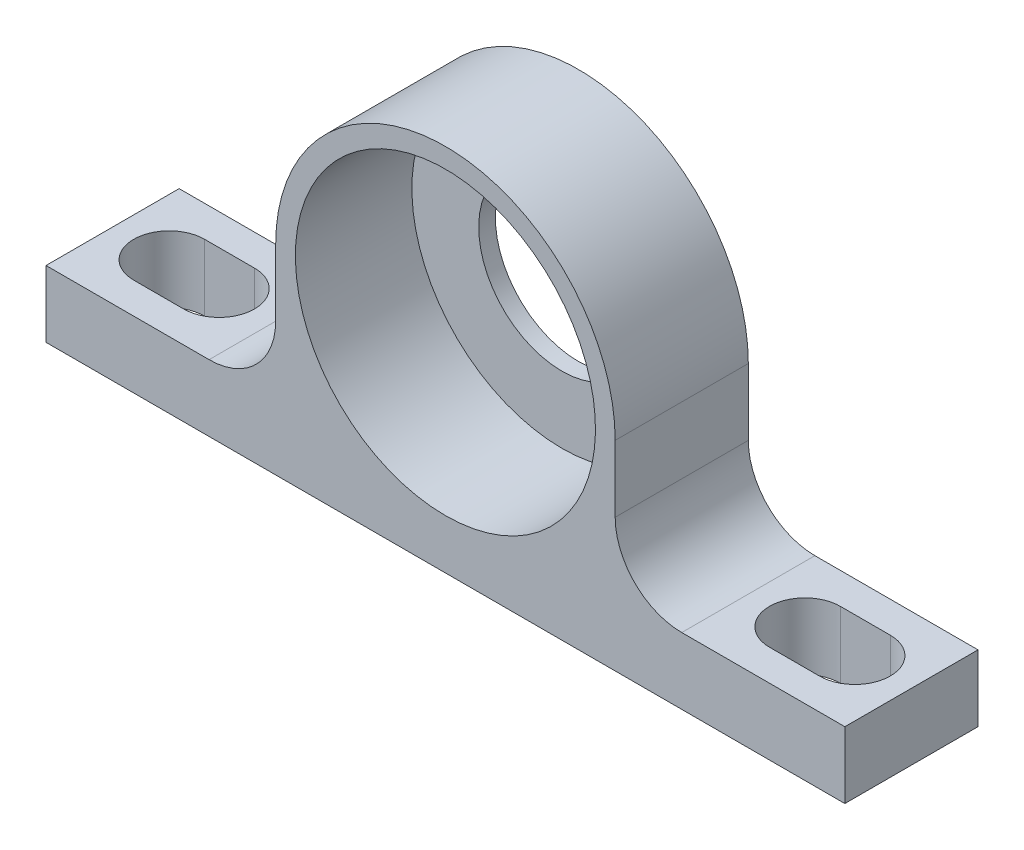
ISO-10303-21;
HEADER;
FILE_DESCRIPTION(('STEP AP214'),'2;1');
FILE_NAME('part.step','',(''),(''),'','','');
FILE_SCHEMA(('AUTOMOTIVE_DESIGN { 1 0 10303 214 1 1 1 1 }'));
ENDSEC;
DATA;
#1=APPLICATION_CONTEXT('core data for automotive mechanical design processes');
#2=APPLICATION_PROTOCOL_DEFINITION('international standard','automotive_design',2000,#1);
#3=PRODUCT_CONTEXT('',#1,'mechanical');
#4=PRODUCT('Part','Part','',(#3));
#5=PRODUCT_RELATED_PRODUCT_CATEGORY('part','',(#4));
#6=PRODUCT_DEFINITION_FORMATION('','',#4);
#7=PRODUCT_DEFINITION_CONTEXT('part definition',#1,'design');
#8=PRODUCT_DEFINITION('design','',#6,#7);
#9=PRODUCT_DEFINITION_SHAPE('','',#8);
#10=(LENGTH_UNIT() NAMED_UNIT(*) SI_UNIT(.MILLI.,.METRE.));
#11=(NAMED_UNIT(*) PLANE_ANGLE_UNIT() SI_UNIT($,.RADIAN.));
#12=(NAMED_UNIT(*) SI_UNIT($,.STERADIAN.) SOLID_ANGLE_UNIT());
#13=UNCERTAINTY_MEASURE_WITH_UNIT(LENGTH_MEASURE(1.E-05),#10,'distance_accuracy_value','');
#14=(GEOMETRIC_REPRESENTATION_CONTEXT(3) GLOBAL_UNCERTAINTY_ASSIGNED_CONTEXT((#13)) GLOBAL_UNIT_ASSIGNED_CONTEXT((#10,
#11,#12)) REPRESENTATION_CONTEXT('',''));
#15=CARTESIAN_POINT('',(0.,0.,0.));
#16=DIRECTION('',(0.,0.,1.));
#17=DIRECTION('',(1.,0.,0.));
#18=AXIS2_PLACEMENT_3D('',#15,#16,#17);
#19=CARTESIAN_POINT('',(27.94,6.35,0.));
#20=DIRECTION('',(0.,1.,0.));
#21=DIRECTION('',(1.,0.,0.));
#22=AXIS2_PLACEMENT_3D('',#19,#20,#21);
#23=CYLINDRICAL_SURFACE('',#22,3.3782);
#24=CARTESIAN_POINT('',(27.94,0.,0.));
#25=DIRECTION('',(0.,1.,0.));
#26=DIRECTION('',(1.,0.,0.));
#27=AXIS2_PLACEMENT_3D('',#24,#25,#26);
#28=CIRCLE('',#27,3.3782);
#29=CARTESIAN_POINT('',(27.94,0.,-3.3782));
#30=VERTEX_POINT('',#29);
#31=CARTESIAN_POINT('',(27.94,0.,3.3782));
#32=VERTEX_POINT('',#31);
#33=EDGE_CURVE('E33',#30,#32,#28,.T.);
#34=ORIENTED_EDGE('',*,*,#33,.F.);
#35=DIRECTION('',(0.,-1.,0.));
#36=VECTOR('',#35,1.);
#37=CARTESIAN_POINT('',(27.94,6.35,-3.3782));
#38=LINE('',#37,#36);
#39=CARTESIAN_POINT('',(27.94,6.35,-3.3782));
#40=VERTEX_POINT('',#39);
#41=EDGE_CURVE('E25',#40,#30,#38,.T.);
#42=ORIENTED_EDGE('',*,*,#41,.F.);
#43=CARTESIAN_POINT('',(27.94,6.35,0.));
#44=DIRECTION('',(0.,-1.,0.));
#45=DIRECTION('',(0.,0.,-1.));
#46=AXIS2_PLACEMENT_3D('',#43,#44,#45);
#47=CIRCLE('',#46,3.3782);
#48=CARTESIAN_POINT('',(27.94,6.35,3.3782));
#49=VERTEX_POINT('',#48);
#50=EDGE_CURVE('E225',#49,#40,#47,.T.);
#51=ORIENTED_EDGE('',*,*,#50,.F.);
#52=DIRECTION('',(0.,-1.,0.));
#53=VECTOR('',#52,1.);
#54=CARTESIAN_POINT('',(27.94,6.35,3.3782));
#55=LINE('',#54,#53);
#56=EDGE_CURVE('E9',#49,#32,#55,.T.);
#57=ORIENTED_EDGE('',*,*,#56,.T.);
#58=EDGE_LOOP('',(#34,#42,#51,#57));
#59=FACE_BOUND('',#58,.T.);
#60=ADVANCED_FACE('F15',(#59),#23,.F.);
#61=CARTESIAN_POINT('',(27.94,6.35,-3.3782));
#62=DIRECTION('',(0.,0.,-1.));
#63=DIRECTION('',(-1.,0.,0.));
#64=AXIS2_PLACEMENT_3D('',#61,#62,#63);
#65=PLANE('',#64);
#66=DIRECTION('',(-1.,0.,0.));
#67=VECTOR('',#66,1.);
#68=CARTESIAN_POINT('',(13.97,0.,-3.3782));
#69=LINE('',#68,#67);
#70=CARTESIAN_POINT('',(32.7025,0.,-3.3782));
#71=VERTEX_POINT('',#70);
#72=EDGE_CURVE('E325',#71,#30,#69,.T.);
#73=ORIENTED_EDGE('',*,*,#72,.F.);
#74=DIRECTION('',(0.,-1.,0.));
#75=VECTOR('',#74,1.);
#76=CARTESIAN_POINT('',(32.7025,6.35,-3.3782));
#77=LINE('',#76,#75);
#78=CARTESIAN_POINT('',(32.7025,6.35,-3.3782));
#79=VERTEX_POINT('',#78);
#80=EDGE_CURVE('E387',#79,#71,#77,.T.);
#81=ORIENTED_EDGE('',*,*,#80,.F.);
#82=DIRECTION('',(1.,0.,0.));
#83=VECTOR('',#82,1.);
#84=CARTESIAN_POINT('',(25.24125,6.35,-3.3782));
#85=LINE('',#84,#83);
#86=EDGE_CURVE('E381',#40,#79,#85,.T.);
#87=ORIENTED_EDGE('',*,*,#86,.F.);
#88=ORIENTED_EDGE('',*,*,#41,.T.);
#89=EDGE_LOOP('',(#73,#81,#87,#88));
#90=FACE_BOUND('',#89,.T.);
#91=ADVANCED_FACE('F279',(#90),#65,.F.);
#92=CARTESIAN_POINT('',(32.7025,6.35,0.));
#93=DIRECTION('',(0.,1.,0.));
#94=DIRECTION('',(1.,0.,0.));
#95=AXIS2_PLACEMENT_3D('',#92,#93,#94);
#96=CYLINDRICAL_SURFACE('',#95,3.3782);
#97=CARTESIAN_POINT('',(32.7025,0.,0.));
#98=DIRECTION('',(0.,1.,0.));
#99=DIRECTION('',(1.,0.,0.));
#100=AXIS2_PLACEMENT_3D('',#97,#98,#99);
#101=CIRCLE('',#100,3.3782);
#102=CARTESIAN_POINT('',(32.7025,0.,3.3782));
#103=VERTEX_POINT('',#102);
#104=EDGE_CURVE('E397',#103,#71,#101,.T.);
#105=ORIENTED_EDGE('',*,*,#104,.F.);
#106=DIRECTION('',(0.,-1.,0.));
#107=VECTOR('',#106,1.);
#108=CARTESIAN_POINT('',(32.7025,6.35,3.3782));
#109=LINE('',#108,#107);
#110=CARTESIAN_POINT('',(32.7025,6.35,3.3782));
#111=VERTEX_POINT('',#110);
#112=EDGE_CURVE('E401',#111,#103,#109,.T.);
#113=ORIENTED_EDGE('',*,*,#112,.F.);
#114=CARTESIAN_POINT('',(32.7025,6.35,0.));
#115=DIRECTION('',(0.,-1.,0.));
#116=DIRECTION('',(0.,0.,-1.));
#117=AXIS2_PLACEMENT_3D('',#114,#115,#116);
#118=CIRCLE('',#117,3.3782);
#119=EDGE_CURVE('E391',#79,#111,#118,.T.);
#120=ORIENTED_EDGE('',*,*,#119,.F.);
#121=ORIENTED_EDGE('',*,*,#80,.T.);
#122=EDGE_LOOP('',(#105,#113,#120,#121));
#123=FACE_BOUND('',#122,.T.);
#124=ADVANCED_FACE('F284',(#123),#96,.F.);
#125=CARTESIAN_POINT('',(32.7025,6.35,3.3782));
#126=DIRECTION('',(0.,0.,1.));
#127=DIRECTION('',(1.,0.,0.));
#128=AXIS2_PLACEMENT_3D('',#125,#126,#127);
#129=PLANE('',#128);
#130=DIRECTION('',(1.,0.,0.));
#131=VECTOR('',#130,1.);
#132=CARTESIAN_POINT('',(16.35125,0.,3.3782));
#133=LINE('',#132,#131);
#134=EDGE_CURVE('E400',#32,#103,#133,.T.);
#135=ORIENTED_EDGE('',*,*,#134,.F.);
#136=ORIENTED_EDGE('',*,*,#56,.F.);
#137=DIRECTION('',(-1.,0.,0.));
#138=VECTOR('',#137,1.);
#139=CARTESIAN_POINT('',(27.6225,6.35,3.3782));
#140=LINE('',#139,#138);
#141=EDGE_CURVE('E155',#111,#49,#140,.T.);
#142=ORIENTED_EDGE('',*,*,#141,.F.);
#143=ORIENTED_EDGE('',*,*,#112,.T.);
#144=EDGE_LOOP('',(#135,#136,#142,#143));
#145=FACE_BOUND('',#144,.T.);
#146=ADVANCED_FACE('F290',(#145),#129,.F.);
#147=CARTESIAN_POINT('',(-27.94,6.35,0.));
#148=DIRECTION('',(0.,-1.,0.));
#149=DIRECTION('',(0.,0.,-1.));
#150=AXIS2_PLACEMENT_3D('',#147,#148,#149);
#151=CYLINDRICAL_SURFACE('',#150,3.3782);
#152=CARTESIAN_POINT('',(-27.94,0.,0.));
#153=DIRECTION('',(0.,1.,0.));
#154=DIRECTION('',(1.,0.,0.));
#155=AXIS2_PLACEMENT_3D('',#152,#153,#154);
#156=CIRCLE('',#155,3.3782);
#157=CARTESIAN_POINT('',(-27.94,0.,3.3782));
#158=VERTEX_POINT('',#157);
#159=CARTESIAN_POINT('',(-27.94,0.,-3.3782));
#160=VERTEX_POINT('',#159);
#161=EDGE_CURVE('E323',#158,#160,#156,.T.);
#162=ORIENTED_EDGE('',*,*,#161,.F.);
#163=DIRECTION('',(0.,-1.,0.));
#164=VECTOR('',#163,1.);
#165=CARTESIAN_POINT('',(-27.94,6.35,3.3782));
#166=LINE('',#165,#164);
#167=CARTESIAN_POINT('',(-27.94,6.35,3.3782));
#168=VERTEX_POINT('',#167);
#169=EDGE_CURVE('E320',#168,#158,#166,.T.);
#170=ORIENTED_EDGE('',*,*,#169,.F.);
#171=CARTESIAN_POINT('',(-27.94,6.35,0.));
#172=DIRECTION('',(0.,-1.,0.));
#173=DIRECTION('',(0.,0.,-1.));
#174=AXIS2_PLACEMENT_3D('',#171,#172,#173);
#175=CIRCLE('',#174,3.3782);
#176=CARTESIAN_POINT('',(-27.94,6.35,-3.3782));
#177=VERTEX_POINT('',#176);
#178=EDGE_CURVE('E332',#177,#168,#175,.T.);
#179=ORIENTED_EDGE('',*,*,#178,.F.);
#180=DIRECTION('',(0.,-1.,0.));
#181=VECTOR('',#180,1.);
#182=CARTESIAN_POINT('',(-27.94,6.35,-3.3782));
#183=LINE('',#182,#181);
#184=EDGE_CURVE('E403',#177,#160,#183,.T.);
#185=ORIENTED_EDGE('',*,*,#184,.T.);
#186=EDGE_LOOP('',(#162,#170,#179,#185));
#187=FACE_BOUND('',#186,.T.);
#188=ADVANCED_FACE('F296',(#187),#151,.F.);
#189=CARTESIAN_POINT('',(-27.94,6.35,-3.3782));
#190=DIRECTION('',(0.,0.,-1.));
#191=DIRECTION('',(-1.,0.,0.));
#192=AXIS2_PLACEMENT_3D('',#189,#190,#191);
#193=PLANE('',#192);
#194=DIRECTION('',(-1.,0.,0.));
#195=VECTOR('',#194,1.);
#196=CARTESIAN_POINT('',(-13.97,0.,-3.3782));
#197=LINE('',#196,#195);
#198=CARTESIAN_POINT('',(-32.7025,0.,-3.3782));
#199=VERTEX_POINT('',#198);
#200=EDGE_CURVE('E202',#160,#199,#197,.T.);
#201=ORIENTED_EDGE('',*,*,#200,.F.);
#202=ORIENTED_EDGE('',*,*,#184,.F.);
#203=DIRECTION('',(1.,0.,0.));
#204=VECTOR('',#203,1.);
#205=CARTESIAN_POINT('',(-33.02,6.35,-3.3782));
#206=LINE('',#205,#204);
#207=CARTESIAN_POINT('',(-32.7025,6.35,-3.3782));
#208=VERTEX_POINT('',#207);
#209=EDGE_CURVE('E410',#208,#177,#206,.T.);
#210=ORIENTED_EDGE('',*,*,#209,.F.);
#211=DIRECTION('',(0.,-1.,0.));
#212=VECTOR('',#211,1.);
#213=CARTESIAN_POINT('',(-32.7025,6.35,-3.3782));
#214=LINE('',#213,#212);
#215=EDGE_CURVE('E413',#208,#199,#214,.T.);
#216=ORIENTED_EDGE('',*,*,#215,.T.);
#217=EDGE_LOOP('',(#201,#202,#210,#216));
#218=FACE_BOUND('',#217,.T.);
#219=ADVANCED_FACE('F292',(#218),#193,.F.);
#220=CARTESIAN_POINT('',(-32.7025,6.35,0.));
#221=DIRECTION('',(0.,-1.,0.));
#222=DIRECTION('',(0.,0.,-1.));
#223=AXIS2_PLACEMENT_3D('',#220,#221,#222);
#224=CYLINDRICAL_SURFACE('',#223,3.3782);
#225=CARTESIAN_POINT('',(-32.7025,0.,0.));
#226=DIRECTION('',(0.,1.,0.));
#227=DIRECTION('',(1.,0.,0.));
#228=AXIS2_PLACEMENT_3D('',#225,#226,#227);
#229=CIRCLE('',#228,3.3782);
#230=CARTESIAN_POINT('',(-32.7025,0.,3.3782));
#231=VERTEX_POINT('',#230);
#232=EDGE_CURVE('E322',#199,#231,#229,.T.);
#233=ORIENTED_EDGE('',*,*,#232,.F.);
#234=ORIENTED_EDGE('',*,*,#215,.F.);
#235=CARTESIAN_POINT('',(-32.7025,6.35,0.));
#236=DIRECTION('',(0.,-1.,0.));
#237=DIRECTION('',(0.,0.,-1.));
#238=AXIS2_PLACEMENT_3D('',#235,#236,#237);
#239=CIRCLE('',#238,3.3782);
#240=CARTESIAN_POINT('',(-32.7025,6.35,3.3782));
#241=VERTEX_POINT('',#240);
#242=EDGE_CURVE('E204',#241,#208,#239,.T.);
#243=ORIENTED_EDGE('',*,*,#242,.F.);
#244=DIRECTION('',(0.,-1.,0.));
#245=VECTOR('',#244,1.);
#246=CARTESIAN_POINT('',(-32.7025,6.35,3.3782));
#247=LINE('',#246,#245);
#248=EDGE_CURVE('E317',#241,#231,#247,.T.);
#249=ORIENTED_EDGE('',*,*,#248,.T.);
#250=EDGE_LOOP('',(#233,#234,#243,#249));
#251=FACE_BOUND('',#250,.T.);
#252=ADVANCED_FACE('F295',(#251),#224,.F.);
#253=CARTESIAN_POINT('',(-32.7025,6.35,3.3782));
#254=DIRECTION('',(0.,0.,1.));
#255=DIRECTION('',(1.,0.,0.));
#256=AXIS2_PLACEMENT_3D('',#253,#254,#255);
#257=PLANE('',#256);
#258=DIRECTION('',(1.,0.,0.));
#259=VECTOR('',#258,1.);
#260=CARTESIAN_POINT('',(-16.35125,0.,3.3782));
#261=LINE('',#260,#259);
#262=EDGE_CURVE('E314',#231,#158,#261,.T.);
#263=ORIENTED_EDGE('',*,*,#262,.F.);
#264=ORIENTED_EDGE('',*,*,#248,.F.);
#265=DIRECTION('',(-1.,0.,0.));
#266=VECTOR('',#265,1.);
#267=CARTESIAN_POINT('',(-35.40125,6.35,3.3782));
#268=LINE('',#267,#266);
#269=EDGE_CURVE('E211',#168,#241,#268,.T.);
#270=ORIENTED_EDGE('',*,*,#269,.F.);
#271=ORIENTED_EDGE('',*,*,#169,.T.);
#272=EDGE_LOOP('',(#263,#264,#270,#271));
#273=FACE_BOUND('',#272,.T.);
#274=ADVANCED_FACE('F298',(#273),#257,.F.);
#275=CARTESIAN_POINT('',(0.,19.05,-4.7625));
#276=DIRECTION('',(0.,0.,-1.));
#277=DIRECTION('',(0.,-1.,0.));
#278=AXIS2_PLACEMENT_3D('',#275,#276,#277);
#279=CYLINDRICAL_SURFACE('',#278,7.9375);
#280=CARTESIAN_POINT('',(0.,19.05,-6.35));
#281=DIRECTION('',(0.,0.,1.));
#282=DIRECTION('',(1.,0.,0.));
#283=AXIS2_PLACEMENT_3D('',#280,#281,#282);
#284=CIRCLE('',#283,7.9375);
#285=CARTESIAN_POINT('',(7.9375,19.05,-6.35));
#286=VERTEX_POINT('',#285);
#287=EDGE_CURVE('E333',#286,#286,#284,.T.);
#288=ORIENTED_EDGE('',*,*,#287,.F.);
#289=EDGE_LOOP('',(#288));
#290=FACE_BOUND('',#289,.T.);
#291=CARTESIAN_POINT('',(0.,19.05,-4.7625));
#292=DIRECTION('',(0.,0.,-1.));
#293=DIRECTION('',(0.,-1.,0.));
#294=AXIS2_PLACEMENT_3D('',#291,#292,#293);
#295=CIRCLE('',#294,7.9375);
#296=CARTESIAN_POINT('',(0.,11.1125,-4.7625));
#297=VERTEX_POINT('',#296);
#298=EDGE_CURVE('E336',#297,#297,#295,.T.);
#299=ORIENTED_EDGE('',*,*,#298,.F.);
#300=EDGE_LOOP('',(#299));
#301=FACE_BOUND('',#300,.T.);
#302=ADVANCED_FACE('F300',(#290,#301),#279,.F.);
#303=CARTESIAN_POINT('',(0.,19.05,6.35));
#304=DIRECTION('',(0.,0.,-1.));
#305=DIRECTION('',(0.,-1.,0.));
#306=AXIS2_PLACEMENT_3D('',#303,#304,#305);
#307=CYLINDRICAL_SURFACE('',#306,14.3129);
#308=CARTESIAN_POINT('',(0.,19.05,-4.7625));
#309=DIRECTION('',(0.,0.,1.));
#310=DIRECTION('',(1.,0.,0.));
#311=AXIS2_PLACEMENT_3D('',#308,#309,#310);
#312=CIRCLE('',#311,14.3129);
#313=CARTESIAN_POINT('',(14.3129,19.05,-4.7625));
#314=VERTEX_POINT('',#313);
#315=EDGE_CURVE('E335',#314,#314,#312,.T.);
#316=ORIENTED_EDGE('',*,*,#315,.F.);
#317=EDGE_LOOP('',(#316));
#318=FACE_BOUND('',#317,.T.);
#319=CARTESIAN_POINT('',(0.,19.05,6.35));
#320=DIRECTION('',(0.,0.,-1.));
#321=DIRECTION('',(0.,-1.,0.));
#322=AXIS2_PLACEMENT_3D('',#319,#320,#321);
#323=CIRCLE('',#322,14.3129);
#324=CARTESIAN_POINT('',(0.,4.7371,6.35));
#325=VERTEX_POINT('',#324);
#326=EDGE_CURVE('E149',#325,#325,#323,.T.);
#327=ORIENTED_EDGE('',*,*,#326,.F.);
#328=EDGE_LOOP('',(#327));
#329=FACE_BOUND('',#328,.T.);
#330=ADVANCED_FACE('F274',(#318,#329),#307,.F.);
#331=CARTESIAN_POINT('',(0.,19.05,-4.7625));
#332=DIRECTION('',(0.,0.,-1.));
#333=DIRECTION('',(-1.,0.,0.));
#334=AXIS2_PLACEMENT_3D('',#331,#332,#333);
#335=PLANE('',#334);
#336=ORIENTED_EDGE('',*,*,#298,.T.);
#337=EDGE_LOOP('',(#336));
#338=FACE_BOUND('',#337,.T.);
#339=ORIENTED_EDGE('',*,*,#315,.T.);
#340=EDGE_LOOP('',(#339));
#341=FACE_BOUND('',#340,.T.);
#342=ADVANCED_FACE('F264',(#338,#341),#335,.F.);
#343=CARTESIAN_POINT('',(0.,10.1006082041294,-6.35));
#344=DIRECTION('',(0.,0.,1.));
#345=DIRECTION('',(1.,0.,0.));
#346=AXIS2_PLACEMENT_3D('',#343,#344,#345);
#347=PLANE('',#346);
#348=ORIENTED_EDGE('',*,*,#287,.T.);
#349=EDGE_LOOP('',(#348));
#350=FACE_BOUND('',#349,.T.);
#351=DIRECTION('',(0.,1.,0.));
#352=VECTOR('',#351,1.);
#353=CARTESIAN_POINT('',(38.1,0.,-6.35));
#354=LINE('',#353,#352);
#355=CARTESIAN_POINT('',(38.1,0.,-6.35));
#356=VERTEX_POINT('',#355);
#357=CARTESIAN_POINT('',(38.1,6.35,-6.35));
#358=VERTEX_POINT('',#357);
#359=EDGE_CURVE('E147',#356,#358,#354,.T.);
#360=ORIENTED_EDGE('',*,*,#359,.F.);
#361=DIRECTION('',(1.,0.,0.));
#362=VECTOR('',#361,1.);
#363=CARTESIAN_POINT('',(0.,0.,-6.35));
#364=LINE('',#363,#362);
#365=CARTESIAN_POINT('',(-38.1,0.,-6.35));
#366=VERTEX_POINT('',#365);
#367=EDGE_CURVE('E168',#366,#356,#364,.T.);
#368=ORIENTED_EDGE('',*,*,#367,.F.);
#369=DIRECTION('',(0.,-1.,0.));
#370=VECTOR('',#369,1.);
#371=CARTESIAN_POINT('',(-38.1,6.35,-6.35));
#372=LINE('',#371,#370);
#373=CARTESIAN_POINT('',(-38.1,6.35,-6.35));
#374=VERTEX_POINT('',#373);
#375=EDGE_CURVE('E172',#374,#366,#372,.T.);
#376=ORIENTED_EDGE('',*,*,#375,.F.);
#377=DIRECTION('',(-1.,0.,0.));
#378=VECTOR('',#377,1.);
#379=CARTESIAN_POINT('',(-22.5425,6.35,-6.35));
#380=LINE('',#379,#378);
#381=CARTESIAN_POINT('',(-22.5425,6.35,-6.35));
#382=VERTEX_POINT('',#381);
#383=EDGE_CURVE('E176',#382,#374,#380,.T.);
#384=ORIENTED_EDGE('',*,*,#383,.F.);
#385=CARTESIAN_POINT('',(-22.5425,12.7,-6.35));
#386=DIRECTION('',(0.,0.,-1.));
#387=DIRECTION('',(0.,-1.,0.));
#388=AXIS2_PLACEMENT_3D('',#385,#386,#387);
#389=CIRCLE('',#388,6.35000000000001);
#390=CARTESIAN_POINT('',(-16.1925,12.7,-6.35));
#391=VERTEX_POINT('',#390);
#392=EDGE_CURVE('E180',#391,#382,#389,.T.);
#393=ORIENTED_EDGE('',*,*,#392,.F.);
#394=DIRECTION('',(0.,-1.,0.));
#395=VECTOR('',#394,1.);
#396=CARTESIAN_POINT('',(-16.1925,19.05,-6.35));
#397=LINE('',#396,#395);
#398=CARTESIAN_POINT('',(-16.1925,19.05,-6.35));
#399=VERTEX_POINT('',#398);
#400=EDGE_CURVE('E184',#399,#391,#397,.T.);
#401=ORIENTED_EDGE('',*,*,#400,.F.);
#402=CARTESIAN_POINT('',(0.,19.05,-6.35));
#403=DIRECTION('',(0.,0.,1.));
#404=DIRECTION('',(1.,0.,0.));
#405=AXIS2_PLACEMENT_3D('',#402,#403,#404);
#406=CIRCLE('',#405,16.1925);
#407=CARTESIAN_POINT('',(16.1925,19.05,-6.35));
#408=VERTEX_POINT('',#407);
#409=EDGE_CURVE('E188',#408,#399,#406,.T.);
#410=ORIENTED_EDGE('',*,*,#409,.F.);
#411=DIRECTION('',(0.,1.,0.));
#412=VECTOR('',#411,1.);
#413=CARTESIAN_POINT('',(16.1925,12.7,-6.35));
#414=LINE('',#413,#412);
#415=CARTESIAN_POINT('',(16.1925,12.7,-6.35));
#416=VERTEX_POINT('',#415);
#417=EDGE_CURVE('E192',#416,#408,#414,.T.);
#418=ORIENTED_EDGE('',*,*,#417,.F.);
#419=CARTESIAN_POINT('',(22.5425,12.7,-6.35));
#420=DIRECTION('',(0.,0.,-1.));
#421=DIRECTION('',(0.,-1.,0.));
#422=AXIS2_PLACEMENT_3D('',#419,#420,#421);
#423=CIRCLE('',#422,6.35);
#424=CARTESIAN_POINT('',(22.5425,6.35,-6.35));
#425=VERTEX_POINT('',#424);
#426=EDGE_CURVE('E196',#425,#416,#423,.T.);
#427=ORIENTED_EDGE('',*,*,#426,.F.);
#428=DIRECTION('',(-1.,0.,0.));
#429=VECTOR('',#428,1.);
#430=CARTESIAN_POINT('',(38.1,6.35,-6.35));
#431=LINE('',#430,#429);
#432=EDGE_CURVE('E156',#358,#425,#431,.T.);
#433=ORIENTED_EDGE('',*,*,#432,.F.);
#434=EDGE_LOOP('',(#360,#368,#376,#384,#393,#401,#410,#418,#427,#433));
#435=FACE_BOUND('',#434,.T.);
#436=ADVANCED_FACE('F261',(#350,#435),#347,.F.);
#437=CARTESIAN_POINT('',(0.,0.,0.));
#438=DIRECTION('',(0.,-1.,0.));
#439=DIRECTION('',(0.,0.,-1.));
#440=AXIS2_PLACEMENT_3D('',#437,#438,#439);
#441=PLANE('',#440);
#442=ORIENTED_EDGE('',*,*,#33,.T.);
#443=ORIENTED_EDGE('',*,*,#134,.T.);
#444=ORIENTED_EDGE('',*,*,#104,.T.);
#445=ORIENTED_EDGE('',*,*,#72,.T.);
#446=EDGE_LOOP('',(#442,#443,#444,#445));
#447=FACE_BOUND('',#446,.T.);
#448=ORIENTED_EDGE('',*,*,#232,.T.);
#449=ORIENTED_EDGE('',*,*,#262,.T.);
#450=ORIENTED_EDGE('',*,*,#161,.T.);
#451=ORIENTED_EDGE('',*,*,#200,.T.);
#452=EDGE_LOOP('',(#448,#449,#450,#451));
#453=FACE_BOUND('',#452,.T.);
#454=DIRECTION('',(-1.,0.,0.));
#455=VECTOR('',#454,1.);
#456=CARTESIAN_POINT('',(-38.1,0.,6.35));
#457=LINE('',#456,#455);
#458=CARTESIAN_POINT('',(38.1,0.,6.35));
#459=VERTEX_POINT('',#458);
#460=CARTESIAN_POINT('',(-38.1,0.,6.35));
#461=VERTEX_POINT('',#460);
#462=EDGE_CURVE('E162',#459,#461,#457,.T.);
#463=ORIENTED_EDGE('',*,*,#462,.T.);
#464=DIRECTION('',(0.,0.,1.));
#465=VECTOR('',#464,1.);
#466=CARTESIAN_POINT('',(-38.1,0.,0.));
#467=LINE('',#466,#465);
#468=EDGE_CURVE('E175',#366,#461,#467,.T.);
#469=ORIENTED_EDGE('',*,*,#468,.F.);
#470=ORIENTED_EDGE('',*,*,#367,.T.);
#471=DIRECTION('',(0.,0.,1.));
#472=VECTOR('',#471,1.);
#473=CARTESIAN_POINT('',(38.1,0.,0.));
#474=LINE('',#473,#472);
#475=EDGE_CURVE('E171',#356,#459,#474,.T.);
#476=ORIENTED_EDGE('',*,*,#475,.T.);
#477=EDGE_LOOP('',(#463,#469,#470,#476));
#478=FACE_BOUND('',#477,.T.);
#479=ADVANCED_FACE('F259',(#447,#453,#478),#441,.T.);
#480=CARTESIAN_POINT('',(-38.1,0.,0.));
#481=DIRECTION('',(-1.,0.,0.));
#482=DIRECTION('',(0.,0.,1.));
#483=AXIS2_PLACEMENT_3D('',#480,#481,#482);
#484=PLANE('',#483);
#485=DIRECTION('',(0.,1.,0.));
#486=VECTOR('',#485,1.);
#487=CARTESIAN_POINT('',(-38.1,6.35,6.35));
#488=LINE('',#487,#486);
#489=CARTESIAN_POINT('',(-38.1,6.35,6.35));
#490=VERTEX_POINT('',#489);
#491=EDGE_CURVE('E174',#461,#490,#488,.T.);
#492=ORIENTED_EDGE('',*,*,#491,.T.);
#493=DIRECTION('',(0.,0.,1.));
#494=VECTOR('',#493,1.);
#495=CARTESIAN_POINT('',(-38.1,6.35,0.));
#496=LINE('',#495,#494);
#497=EDGE_CURVE('E179',#374,#490,#496,.T.);
#498=ORIENTED_EDGE('',*,*,#497,.F.);
#499=ORIENTED_EDGE('',*,*,#375,.T.);
#500=ORIENTED_EDGE('',*,*,#468,.T.);
#501=EDGE_LOOP('',(#492,#498,#499,#500));
#502=FACE_BOUND('',#501,.T.);
#503=ADVANCED_FACE('F255',(#502),#484,.T.);
#504=CARTESIAN_POINT('',(-38.1,6.35,0.));
#505=DIRECTION('',(0.,1.,0.));
#506=DIRECTION('',(0.,0.,1.));
#507=AXIS2_PLACEMENT_3D('',#504,#505,#506);
#508=PLANE('',#507);
#509=ORIENTED_EDGE('',*,*,#242,.T.);
#510=ORIENTED_EDGE('',*,*,#209,.T.);
#511=ORIENTED_EDGE('',*,*,#178,.T.);
#512=ORIENTED_EDGE('',*,*,#269,.T.);
#513=EDGE_LOOP('',(#509,#510,#511,#512));
#514=FACE_BOUND('',#513,.T.);
#515=DIRECTION('',(1.,0.,0.));
#516=VECTOR('',#515,1.);
#517=CARTESIAN_POINT('',(-22.5425,6.35,6.35));
#518=LINE('',#517,#516);
#519=CARTESIAN_POINT('',(-22.5425,6.35,6.35));
#520=VERTEX_POINT('',#519);
#521=EDGE_CURVE('E178',#490,#520,#518,.T.);
#522=ORIENTED_EDGE('',*,*,#521,.T.);
#523=DIRECTION('',(0.,0.,1.));
#524=VECTOR('',#523,1.);
#525=CARTESIAN_POINT('',(-22.5425,6.35,0.));
#526=LINE('',#525,#524);
#527=EDGE_CURVE('E183',#382,#520,#526,.T.);
#528=ORIENTED_EDGE('',*,*,#527,.F.);
#529=ORIENTED_EDGE('',*,*,#383,.T.);
#530=ORIENTED_EDGE('',*,*,#497,.T.);
#531=EDGE_LOOP('',(#522,#528,#529,#530));
#532=FACE_BOUND('',#531,.T.);
#533=ADVANCED_FACE('F251',(#514,#532),#508,.T.);
#534=CARTESIAN_POINT('',(-22.5425,12.7,0.));
#535=DIRECTION('',(0.,0.,1.));
#536=DIRECTION('',(1.,0.,0.));
#537=AXIS2_PLACEMENT_3D('',#534,#535,#536);
#538=CYLINDRICAL_SURFACE('',#537,6.35000000000001);
#539=CARTESIAN_POINT('',(-22.5425,12.7,6.35));
#540=DIRECTION('',(0.,0.,1.));
#541=DIRECTION('',(1.,0.,0.));
#542=AXIS2_PLACEMENT_3D('',#539,#540,#541);
#543=CIRCLE('',#542,6.35000000000001);
#544=CARTESIAN_POINT('',(-16.1925,12.7,6.35));
#545=VERTEX_POINT('',#544);
#546=EDGE_CURVE('E182',#520,#545,#543,.T.);
#547=ORIENTED_EDGE('',*,*,#546,.T.);
#548=DIRECTION('',(0.,0.,1.));
#549=VECTOR('',#548,1.);
#550=CARTESIAN_POINT('',(-16.1925,12.7,0.));
#551=LINE('',#550,#549);
#552=EDGE_CURVE('E187',#391,#545,#551,.T.);
#553=ORIENTED_EDGE('',*,*,#552,.F.);
#554=ORIENTED_EDGE('',*,*,#392,.T.);
#555=ORIENTED_EDGE('',*,*,#527,.T.);
#556=EDGE_LOOP('',(#547,#553,#554,#555));
#557=FACE_BOUND('',#556,.T.);
#558=ADVANCED_FACE('F246',(#557),#538,.F.);
#559=CARTESIAN_POINT('',(-16.1925,12.7,0.));
#560=DIRECTION('',(-1.,0.,0.));
#561=DIRECTION('',(0.,0.,1.));
#562=AXIS2_PLACEMENT_3D('',#559,#560,#561);
#563=PLANE('',#562);
#564=DIRECTION('',(0.,1.,0.));
#565=VECTOR('',#564,1.);
#566=CARTESIAN_POINT('',(-16.1925,19.05,6.35));
#567=LINE('',#566,#565);
#568=CARTESIAN_POINT('',(-16.1925,19.05,6.35));
#569=VERTEX_POINT('',#568);
#570=EDGE_CURVE('E186',#545,#569,#567,.T.);
#571=ORIENTED_EDGE('',*,*,#570,.T.);
#572=DIRECTION('',(0.,0.,1.));
#573=VECTOR('',#572,1.);
#574=CARTESIAN_POINT('',(-16.1925,19.05,0.));
#575=LINE('',#574,#573);
#576=EDGE_CURVE('E191',#399,#569,#575,.T.);
#577=ORIENTED_EDGE('',*,*,#576,.F.);
#578=ORIENTED_EDGE('',*,*,#400,.T.);
#579=ORIENTED_EDGE('',*,*,#552,.T.);
#580=EDGE_LOOP('',(#571,#577,#578,#579));
#581=FACE_BOUND('',#580,.T.);
#582=ADVANCED_FACE('F241',(#581),#563,.T.);
#583=CARTESIAN_POINT('',(0.,19.05,0.));
#584=DIRECTION('',(0.,0.,1.));
#585=DIRECTION('',(1.,0.,0.));
#586=AXIS2_PLACEMENT_3D('',#583,#584,#585);
#587=CYLINDRICAL_SURFACE('',#586,16.1925);
#588=CARTESIAN_POINT('',(0.,19.05,6.35));
#589=DIRECTION('',(0.,0.,-1.));
#590=DIRECTION('',(0.,-1.,0.));
#591=AXIS2_PLACEMENT_3D('',#588,#589,#590);
#592=CIRCLE('',#591,16.1925);
#593=CARTESIAN_POINT('',(16.1925,19.05,6.35));
#594=VERTEX_POINT('',#593);
#595=EDGE_CURVE('E190',#569,#594,#592,.T.);
#596=ORIENTED_EDGE('',*,*,#595,.T.);
#597=DIRECTION('',(0.,0.,1.));
#598=VECTOR('',#597,1.);
#599=CARTESIAN_POINT('',(16.1925,19.05,0.));
#600=LINE('',#599,#598);
#601=EDGE_CURVE('E195',#408,#594,#600,.T.);
#602=ORIENTED_EDGE('',*,*,#601,.F.);
#603=ORIENTED_EDGE('',*,*,#409,.T.);
#604=ORIENTED_EDGE('',*,*,#576,.T.);
#605=EDGE_LOOP('',(#596,#602,#603,#604));
#606=FACE_BOUND('',#605,.T.);
#607=ADVANCED_FACE('F237',(#606),#587,.T.);
#608=CARTESIAN_POINT('',(16.1925,19.05,0.));
#609=DIRECTION('',(1.,0.,0.));
#610=DIRECTION('',(0.,1.,0.));
#611=AXIS2_PLACEMENT_3D('',#608,#609,#610);
#612=PLANE('',#611);
#613=DIRECTION('',(0.,-1.,0.));
#614=VECTOR('',#613,1.);
#615=CARTESIAN_POINT('',(16.1925,12.7,6.35));
#616=LINE('',#615,#614);
#617=CARTESIAN_POINT('',(16.1925,12.7,6.35));
#618=VERTEX_POINT('',#617);
#619=EDGE_CURVE('E194',#594,#618,#616,.T.);
#620=ORIENTED_EDGE('',*,*,#619,.T.);
#621=DIRECTION('',(0.,0.,1.));
#622=VECTOR('',#621,1.);
#623=CARTESIAN_POINT('',(16.1925,12.7,0.));
#624=LINE('',#623,#622);
#625=EDGE_CURVE('E199',#416,#618,#624,.T.);
#626=ORIENTED_EDGE('',*,*,#625,.F.);
#627=ORIENTED_EDGE('',*,*,#417,.T.);
#628=ORIENTED_EDGE('',*,*,#601,.T.);
#629=EDGE_LOOP('',(#620,#626,#627,#628));
#630=FACE_BOUND('',#629,.T.);
#631=ADVANCED_FACE('F232',(#630),#612,.T.);
#632=CARTESIAN_POINT('',(22.5425,12.7,0.));
#633=DIRECTION('',(0.,0.,1.));
#634=DIRECTION('',(1.,0.,0.));
#635=AXIS2_PLACEMENT_3D('',#632,#633,#634);
#636=CYLINDRICAL_SURFACE('',#635,6.35);
#637=CARTESIAN_POINT('',(22.5425,12.7,6.35));
#638=DIRECTION('',(0.,0.,1.));
#639=DIRECTION('',(1.,0.,0.));
#640=AXIS2_PLACEMENT_3D('',#637,#638,#639);
#641=CIRCLE('',#640,6.35);
#642=CARTESIAN_POINT('',(22.5425,6.35,6.35));
#643=VERTEX_POINT('',#642);
#644=EDGE_CURVE('E198',#618,#643,#641,.T.);
#645=ORIENTED_EDGE('',*,*,#644,.T.);
#646=DIRECTION('',(0.,0.,1.));
#647=VECTOR('',#646,1.);
#648=CARTESIAN_POINT('',(22.5425,6.35,0.));
#649=LINE('',#648,#647);
#650=EDGE_CURVE('E137',#425,#643,#649,.T.);
#651=ORIENTED_EDGE('',*,*,#650,.F.);
#652=ORIENTED_EDGE('',*,*,#426,.T.);
#653=ORIENTED_EDGE('',*,*,#625,.T.);
#654=EDGE_LOOP('',(#645,#651,#652,#653));
#655=FACE_BOUND('',#654,.T.);
#656=ADVANCED_FACE('F17',(#655),#636,.F.);
#657=CARTESIAN_POINT('',(22.5425,6.35,0.));
#658=DIRECTION('',(0.,1.,0.));
#659=DIRECTION('',(0.,0.,1.));
#660=AXIS2_PLACEMENT_3D('',#657,#658,#659);
#661=PLANE('',#660);
#662=ORIENTED_EDGE('',*,*,#50,.T.);
#663=ORIENTED_EDGE('',*,*,#86,.T.);
#664=ORIENTED_EDGE('',*,*,#119,.T.);
#665=ORIENTED_EDGE('',*,*,#141,.T.);
#666=EDGE_LOOP('',(#662,#663,#664,#665));
#667=FACE_BOUND('',#666,.T.);
#668=DIRECTION('',(1.,0.,0.));
#669=VECTOR('',#668,1.);
#670=CARTESIAN_POINT('',(38.1,6.35,6.35));
#671=LINE('',#670,#669);
#672=CARTESIAN_POINT('',(38.1,6.35,6.35));
#673=VERTEX_POINT('',#672);
#674=EDGE_CURVE('E151',#643,#673,#671,.T.);
#675=ORIENTED_EDGE('',*,*,#674,.T.);
#676=DIRECTION('',(0.,0.,1.));
#677=VECTOR('',#676,1.);
#678=CARTESIAN_POINT('',(38.1,6.35,0.));
#679=LINE('',#678,#677);
#680=EDGE_CURVE('E143',#358,#673,#679,.T.);
#681=ORIENTED_EDGE('',*,*,#680,.F.);
#682=ORIENTED_EDGE('',*,*,#432,.T.);
#683=ORIENTED_EDGE('',*,*,#650,.T.);
#684=EDGE_LOOP('',(#675,#681,#682,#683));
#685=FACE_BOUND('',#684,.T.);
#686=ADVANCED_FACE('F152',(#667,#685),#661,.T.);
#687=CARTESIAN_POINT('',(38.1,6.35,0.));
#688=DIRECTION('',(1.,0.,0.));
#689=DIRECTION('',(0.,0.,-1.));
#690=AXIS2_PLACEMENT_3D('',#687,#688,#689);
#691=PLANE('',#690);
#692=DIRECTION('',(0.,-1.,0.));
#693=VECTOR('',#692,1.);
#694=CARTESIAN_POINT('',(38.1,0.,6.35));
#695=LINE('',#694,#693);
#696=EDGE_CURVE('E19',#673,#459,#695,.T.);
#697=ORIENTED_EDGE('',*,*,#696,.T.);
#698=ORIENTED_EDGE('',*,*,#475,.F.);
#699=ORIENTED_EDGE('',*,*,#359,.T.);
#700=ORIENTED_EDGE('',*,*,#680,.T.);
#701=EDGE_LOOP('',(#697,#698,#699,#700));
#702=FACE_BOUND('',#701,.T.);
#703=ADVANCED_FACE('F144',(#702),#691,.T.);
#704=CARTESIAN_POINT('',(0.,10.1006082041294,6.35));
#705=DIRECTION('',(0.,0.,1.));
#706=DIRECTION('',(1.,0.,0.));
#707=AXIS2_PLACEMENT_3D('',#704,#705,#706);
#708=PLANE('',#707);
#709=ORIENTED_EDGE('',*,*,#326,.T.);
#710=EDGE_LOOP('',(#709));
#711=FACE_BOUND('',#710,.T.);
#712=ORIENTED_EDGE('',*,*,#462,.F.);
#713=ORIENTED_EDGE('',*,*,#696,.F.);
#714=ORIENTED_EDGE('',*,*,#674,.F.);
#715=ORIENTED_EDGE('',*,*,#644,.F.);
#716=ORIENTED_EDGE('',*,*,#619,.F.);
#717=ORIENTED_EDGE('',*,*,#595,.F.);
#718=ORIENTED_EDGE('',*,*,#570,.F.);
#719=ORIENTED_EDGE('',*,*,#546,.F.);
#720=ORIENTED_EDGE('',*,*,#521,.F.);
#721=ORIENTED_EDGE('',*,*,#491,.F.);
#722=EDGE_LOOP('',(#712,#713,#714,#715,#716,#717,#718,#719,#720,#721));
#723=FACE_BOUND('',#722,.T.);
#724=ADVANCED_FACE('F159',(#711,#723),#708,.T.);
#725=CLOSED_SHELL('',(#60,#91,#124,#146,#188,#219,#252,#274,#302,#330,#342,#436,#479,#503,#533,
#558,#582,#607,#631,#656,#686,#703,#724));
#726=MANIFOLD_SOLID_BREP('B1',#725);
#727=ADVANCED_BREP_SHAPE_REPRESENTATION('',(#18,#726),#14);
#728=SHAPE_DEFINITION_REPRESENTATION(#9,#727);
ENDSEC;
END-ISO-10303-21;
